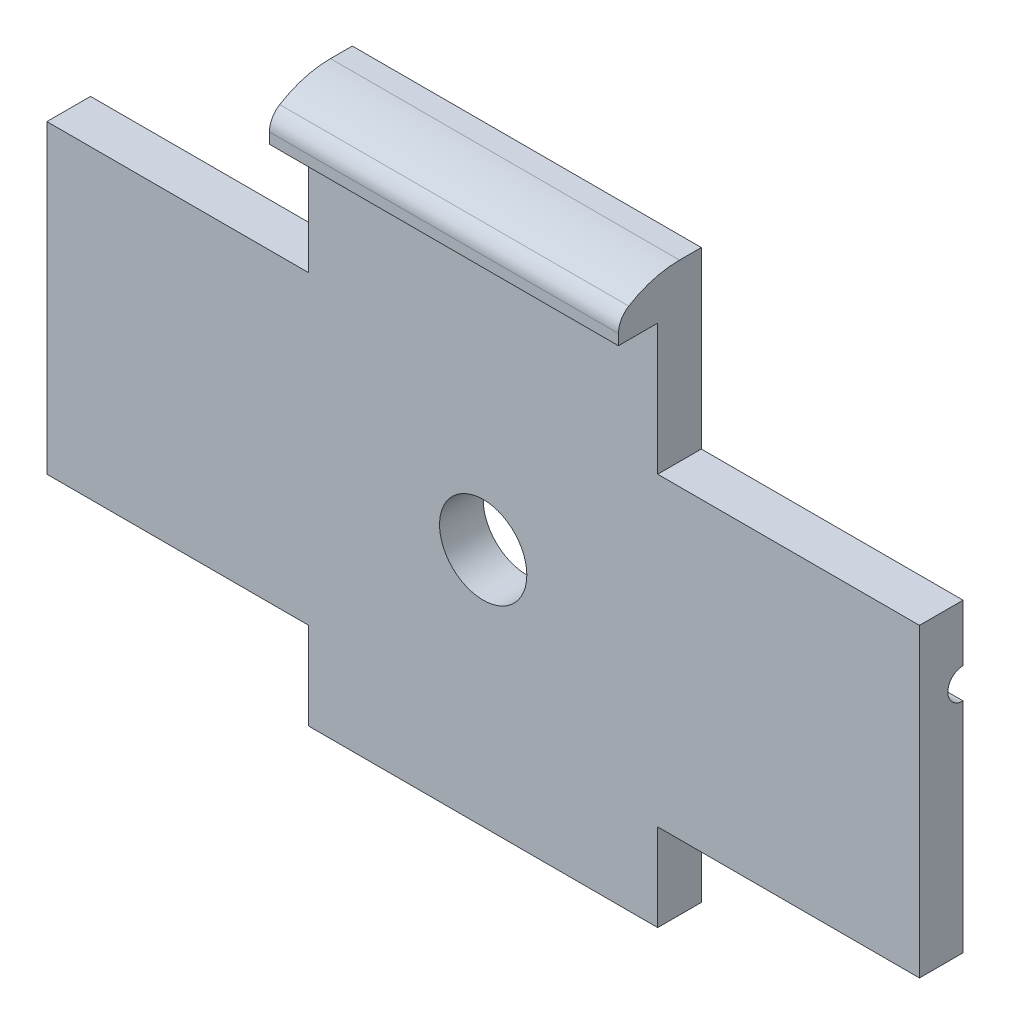
ISO-10303-21;
HEADER;
FILE_DESCRIPTION(('STEP AP214'),'2;1');
FILE_NAME('part.step','',(''),(''),'','','');
FILE_SCHEMA(('AUTOMOTIVE_DESIGN { 1 0 10303 214 1 1 1 1 }'));
ENDSEC;
DATA;
#1=APPLICATION_CONTEXT('core data for automotive mechanical design processes');
#2=APPLICATION_PROTOCOL_DEFINITION('international standard','automotive_design',2000,#1);
#3=PRODUCT_CONTEXT('',#1,'mechanical');
#4=PRODUCT('Part','Part','',(#3));
#5=PRODUCT_RELATED_PRODUCT_CATEGORY('part','',(#4));
#6=PRODUCT_DEFINITION_FORMATION('','',#4);
#7=PRODUCT_DEFINITION_CONTEXT('part definition',#1,'design');
#8=PRODUCT_DEFINITION('design','',#6,#7);
#9=PRODUCT_DEFINITION_SHAPE('','',#8);
#10=(LENGTH_UNIT() NAMED_UNIT(*) SI_UNIT(.MILLI.,.METRE.));
#11=(NAMED_UNIT(*) PLANE_ANGLE_UNIT() SI_UNIT($,.RADIAN.));
#12=(NAMED_UNIT(*) SI_UNIT($,.STERADIAN.) SOLID_ANGLE_UNIT());
#13=UNCERTAINTY_MEASURE_WITH_UNIT(LENGTH_MEASURE(1.E-05),#10,'distance_accuracy_value','');
#14=(GEOMETRIC_REPRESENTATION_CONTEXT(3) GLOBAL_UNCERTAINTY_ASSIGNED_CONTEXT((#13)) GLOBAL_UNIT_ASSIGNED_CONTEXT((#10,
#11,#12)) REPRESENTATION_CONTEXT('',''));
#15=CARTESIAN_POINT('',(0.,0.,0.));
#16=DIRECTION('',(0.,0.,1.));
#17=DIRECTION('',(1.,0.,0.));
#18=AXIS2_PLACEMENT_3D('',#15,#16,#17);
#19=CARTESIAN_POINT('',(-2.,1.75,0.5));
#20=DIRECTION('',(0.,-1.,0.));
#21=DIRECTION('',(1.,0.,0.));
#22=AXIS2_PLACEMENT_3D('',#19,#20,#21);
#23=PLANE('',#22);
#24=DIRECTION('',(-1.,0.,0.));
#25=VECTOR('',#24,1.);
#26=CARTESIAN_POINT('',(-2.,1.75,0.));
#27=LINE('',#26,#25);
#28=CARTESIAN_POINT('',(-2.,1.75,0.));
#29=VERTEX_POINT('',#28);
#30=CARTESIAN_POINT('',(-5.,1.75,0.));
#31=VERTEX_POINT('',#30);
#32=EDGE_CURVE('E224',#29,#31,#27,.T.);
#33=ORIENTED_EDGE('',*,*,#32,.T.);
#34=DIRECTION('',(0.,0.,-1.));
#35=VECTOR('',#34,1.);
#36=CARTESIAN_POINT('',(-5.,1.75,0.5));
#37=LINE('',#36,#35);
#38=CARTESIAN_POINT('',(-5.,1.75,0.5));
#39=VERTEX_POINT('',#38);
#40=EDGE_CURVE('E203',#39,#31,#37,.T.);
#41=ORIENTED_EDGE('',*,*,#40,.F.);
#42=DIRECTION('',(-1.,0.,0.));
#43=VECTOR('',#42,1.);
#44=CARTESIAN_POINT('',(-2.,1.75,0.5));
#45=LINE('',#44,#43);
#46=CARTESIAN_POINT('',(-2.,1.75,0.5));
#47=VERTEX_POINT('',#46);
#48=EDGE_CURVE('E251',#47,#39,#45,.T.);
#49=ORIENTED_EDGE('',*,*,#48,.F.);
#50=DIRECTION('',(0.,0.,-1.));
#51=VECTOR('',#50,1.);
#52=CARTESIAN_POINT('',(-2.,1.75,0.5));
#53=LINE('',#52,#51);
#54=EDGE_CURVE('E215',#47,#29,#53,.T.);
#55=ORIENTED_EDGE('',*,*,#54,.T.);
#56=EDGE_LOOP('',(#33,#41,#49,#55));
#57=FACE_BOUND('',#56,.T.);
#58=ADVANCED_FACE('F34',(#57),#23,.F.);
#59=CARTESIAN_POINT('',(-5.,1.75,0.5));
#60=DIRECTION('',(1.,0.,0.));
#61=DIRECTION('',(0.,0.,-1.));
#62=AXIS2_PLACEMENT_3D('',#59,#60,#61);
#63=PLANE('',#62);
#64=DIRECTION('',(0.,-1.,0.));
#65=VECTOR('',#64,1.);
#66=CARTESIAN_POINT('',(-5.,1.75,0.));
#67=LINE('',#66,#65);
#68=CARTESIAN_POINT('',(-5.,1.1,0.));
#69=VERTEX_POINT('',#68);
#70=EDGE_CURVE('E229',#31,#69,#67,.T.);
#71=ORIENTED_EDGE('',*,*,#70,.T.);
#72=CARTESIAN_POINT('',(-5.,0.925000000000001,0.));
#73=DIRECTION('',(-1.,0.,0.));
#74=DIRECTION('',(0.,0.,1.));
#75=AXIS2_PLACEMENT_3D('',#72,#73,#74);
#76=CIRCLE('',#75,0.175);
#77=CARTESIAN_POINT('',(-5.,0.750000000000001,0.));
#78=VERTEX_POINT('',#77);
#79=EDGE_CURVE('E186',#78,#69,#76,.T.);
#80=ORIENTED_EDGE('',*,*,#79,.F.);
#81=CARTESIAN_POINT('',(-5.,-1.75,0.));
#82=VERTEX_POINT('',#81);
#83=EDGE_CURVE('E227',#78,#82,#67,.T.);
#84=ORIENTED_EDGE('',*,*,#83,.T.);
#85=DIRECTION('',(0.,0.,-1.));
#86=VECTOR('',#85,1.);
#87=CARTESIAN_POINT('',(-5.,-1.75,0.5));
#88=LINE('',#87,#86);
#89=CARTESIAN_POINT('',(-5.,-1.75,0.5));
#90=VERTEX_POINT('',#89);
#91=EDGE_CURVE('E274',#90,#82,#88,.T.);
#92=ORIENTED_EDGE('',*,*,#91,.F.);
#93=DIRECTION('',(0.,-1.,0.));
#94=VECTOR('',#93,1.);
#95=CARTESIAN_POINT('',(-5.,1.75,0.5));
#96=LINE('',#95,#94);
#97=EDGE_CURVE('E285',#39,#90,#96,.T.);
#98=ORIENTED_EDGE('',*,*,#97,.F.);
#99=ORIENTED_EDGE('',*,*,#40,.T.);
#100=EDGE_LOOP('',(#71,#80,#84,#92,#98,#99));
#101=FACE_BOUND('',#100,.T.);
#102=ADVANCED_FACE('F283',(#101),#63,.F.);
#103=CARTESIAN_POINT('',(-5.,-1.75,0.5));
#104=DIRECTION('',(0.,1.,0.));
#105=DIRECTION('',(-1.,0.,0.));
#106=AXIS2_PLACEMENT_3D('',#103,#104,#105);
#107=PLANE('',#106);
#108=DIRECTION('',(1.,0.,0.));
#109=VECTOR('',#108,1.);
#110=CARTESIAN_POINT('',(-5.,-1.75,0.));
#111=LINE('',#110,#109);
#112=CARTESIAN_POINT('',(-2.,-1.75,0.));
#113=VERTEX_POINT('',#112);
#114=EDGE_CURVE('E232',#82,#113,#111,.T.);
#115=ORIENTED_EDGE('',*,*,#114,.T.);
#116=DIRECTION('',(0.,0.,-1.));
#117=VECTOR('',#116,1.);
#118=CARTESIAN_POINT('',(-2.,-1.75,0.5));
#119=LINE('',#118,#117);
#120=CARTESIAN_POINT('',(-2.,-1.75,0.5));
#121=VERTEX_POINT('',#120);
#122=EDGE_CURVE('E272',#121,#113,#119,.T.);
#123=ORIENTED_EDGE('',*,*,#122,.F.);
#124=DIRECTION('',(1.,0.,0.));
#125=VECTOR('',#124,1.);
#126=CARTESIAN_POINT('',(-5.,-1.75,0.5));
#127=LINE('',#126,#125);
#128=EDGE_CURVE('E328',#90,#121,#127,.T.);
#129=ORIENTED_EDGE('',*,*,#128,.F.);
#130=ORIENTED_EDGE('',*,*,#91,.T.);
#131=EDGE_LOOP('',(#115,#123,#129,#130));
#132=FACE_BOUND('',#131,.T.);
#133=ADVANCED_FACE('F404',(#132),#107,.F.);
#134=CARTESIAN_POINT('',(-2.,-1.75,0.5));
#135=DIRECTION('',(1.,0.,0.));
#136=DIRECTION('',(0.,0.,-1.));
#137=AXIS2_PLACEMENT_3D('',#134,#135,#136);
#138=PLANE('',#137);
#139=DIRECTION('',(0.,-1.,0.));
#140=VECTOR('',#139,1.);
#141=CARTESIAN_POINT('',(-2.,-1.75,0.));
#142=LINE('',#141,#140);
#143=CARTESIAN_POINT('',(-2.,-2.75,0.));
#144=VERTEX_POINT('',#143);
#145=EDGE_CURVE('E234',#113,#144,#142,.T.);
#146=ORIENTED_EDGE('',*,*,#145,.T.);
#147=DIRECTION('',(0.,0.,-1.));
#148=VECTOR('',#147,1.);
#149=CARTESIAN_POINT('',(-2.,-2.75,0.5));
#150=LINE('',#149,#148);
#151=CARTESIAN_POINT('',(-2.,-2.75,0.5));
#152=VERTEX_POINT('',#151);
#153=EDGE_CURVE('E269',#152,#144,#150,.T.);
#154=ORIENTED_EDGE('',*,*,#153,.F.);
#155=DIRECTION('',(0.,-1.,0.));
#156=VECTOR('',#155,1.);
#157=CARTESIAN_POINT('',(-2.,-1.75,0.5));
#158=LINE('',#157,#156);
#159=EDGE_CURVE('E330',#121,#152,#158,.T.);
#160=ORIENTED_EDGE('',*,*,#159,.F.);
#161=ORIENTED_EDGE('',*,*,#122,.T.);
#162=EDGE_LOOP('',(#146,#154,#160,#161));
#163=FACE_BOUND('',#162,.T.);
#164=ADVANCED_FACE('F408',(#163),#138,.F.);
#165=CARTESIAN_POINT('',(-2.,-2.75,0.5));
#166=DIRECTION('',(0.,1.,0.));
#167=DIRECTION('',(-1.,0.,0.));
#168=AXIS2_PLACEMENT_3D('',#165,#166,#167);
#169=PLANE('',#168);
#170=DIRECTION('',(1.,0.,0.));
#171=VECTOR('',#170,1.);
#172=CARTESIAN_POINT('',(-2.,-2.75,0.));
#173=LINE('',#172,#171);
#174=CARTESIAN_POINT('',(2.,-2.75,0.));
#175=VERTEX_POINT('',#174);
#176=EDGE_CURVE('E236',#144,#175,#173,.T.);
#177=ORIENTED_EDGE('',*,*,#176,.T.);
#178=DIRECTION('',(0.,0.,-1.));
#179=VECTOR('',#178,1.);
#180=CARTESIAN_POINT('',(2.,-2.75,0.5));
#181=LINE('',#180,#179);
#182=CARTESIAN_POINT('',(2.,-2.75,0.5));
#183=VERTEX_POINT('',#182);
#184=EDGE_CURVE('E266',#183,#175,#181,.T.);
#185=ORIENTED_EDGE('',*,*,#184,.F.);
#186=DIRECTION('',(1.,0.,0.));
#187=VECTOR('',#186,1.);
#188=CARTESIAN_POINT('',(-2.,-2.75,0.5));
#189=LINE('',#188,#187);
#190=EDGE_CURVE('E332',#152,#183,#189,.T.);
#191=ORIENTED_EDGE('',*,*,#190,.F.);
#192=ORIENTED_EDGE('',*,*,#153,.T.);
#193=EDGE_LOOP('',(#177,#185,#191,#192));
#194=FACE_BOUND('',#193,.T.);
#195=ADVANCED_FACE('F413',(#194),#169,.F.);
#196=CARTESIAN_POINT('',(2.,-2.75,0.5));
#197=DIRECTION('',(-1.,0.,0.));
#198=DIRECTION('',(0.,-1.,0.));
#199=AXIS2_PLACEMENT_3D('',#196,#197,#198);
#200=PLANE('',#199);
#201=DIRECTION('',(0.,1.,0.));
#202=VECTOR('',#201,1.);
#203=CARTESIAN_POINT('',(2.,-2.75,0.));
#204=LINE('',#203,#202);
#205=CARTESIAN_POINT('',(2.,-1.75,0.));
#206=VERTEX_POINT('',#205);
#207=EDGE_CURVE('E238',#175,#206,#204,.T.);
#208=ORIENTED_EDGE('',*,*,#207,.T.);
#209=DIRECTION('',(0.,0.,-1.));
#210=VECTOR('',#209,1.);
#211=CARTESIAN_POINT('',(2.,-1.75,0.5));
#212=LINE('',#211,#210);
#213=CARTESIAN_POINT('',(2.,-1.75,0.5));
#214=VERTEX_POINT('',#213);
#215=EDGE_CURVE('E263',#214,#206,#212,.T.);
#216=ORIENTED_EDGE('',*,*,#215,.F.);
#217=DIRECTION('',(0.,1.,0.));
#218=VECTOR('',#217,1.);
#219=CARTESIAN_POINT('',(2.,-2.75,0.5));
#220=LINE('',#219,#218);
#221=EDGE_CURVE('E334',#183,#214,#220,.T.);
#222=ORIENTED_EDGE('',*,*,#221,.F.);
#223=ORIENTED_EDGE('',*,*,#184,.T.);
#224=EDGE_LOOP('',(#208,#216,#222,#223));
#225=FACE_BOUND('',#224,.T.);
#226=ADVANCED_FACE('F417',(#225),#200,.F.);
#227=CARTESIAN_POINT('',(2.,-1.75,0.5));
#228=DIRECTION('',(0.,1.,0.));
#229=DIRECTION('',(-1.,0.,0.));
#230=AXIS2_PLACEMENT_3D('',#227,#228,#229);
#231=PLANE('',#230);
#232=DIRECTION('',(1.,0.,0.));
#233=VECTOR('',#232,1.);
#234=CARTESIAN_POINT('',(2.,-1.75,0.));
#235=LINE('',#234,#233);
#236=CARTESIAN_POINT('',(5.,-1.75,0.));
#237=VERTEX_POINT('',#236);
#238=EDGE_CURVE('E240',#206,#237,#235,.T.);
#239=ORIENTED_EDGE('',*,*,#238,.T.);
#240=DIRECTION('',(0.,0.,-1.));
#241=VECTOR('',#240,1.);
#242=CARTESIAN_POINT('',(5.,-1.75,0.5));
#243=LINE('',#242,#241);
#244=CARTESIAN_POINT('',(5.,-1.75,0.5));
#245=VERTEX_POINT('',#244);
#246=EDGE_CURVE('E260',#245,#237,#243,.T.);
#247=ORIENTED_EDGE('',*,*,#246,.F.);
#248=DIRECTION('',(1.,0.,0.));
#249=VECTOR('',#248,1.);
#250=CARTESIAN_POINT('',(2.,-1.75,0.5));
#251=LINE('',#250,#249);
#252=EDGE_CURVE('E336',#214,#245,#251,.T.);
#253=ORIENTED_EDGE('',*,*,#252,.F.);
#254=ORIENTED_EDGE('',*,*,#215,.T.);
#255=EDGE_LOOP('',(#239,#247,#253,#254));
#256=FACE_BOUND('',#255,.T.);
#257=ADVANCED_FACE('F421',(#256),#231,.F.);
#258=CARTESIAN_POINT('',(5.,-1.75,0.5));
#259=DIRECTION('',(-1.,0.,0.));
#260=DIRECTION('',(0.,0.,1.));
#261=AXIS2_PLACEMENT_3D('',#258,#259,#260);
#262=PLANE('',#261);
#263=DIRECTION('',(0.,1.,0.));
#264=VECTOR('',#263,1.);
#265=CARTESIAN_POINT('',(5.,-1.75,0.));
#266=LINE('',#265,#264);
#267=CARTESIAN_POINT('',(5.,0.75,0.));
#268=VERTEX_POINT('',#267);
#269=EDGE_CURVE('E242',#237,#268,#266,.T.);
#270=ORIENTED_EDGE('',*,*,#269,.T.);
#271=CARTESIAN_POINT('',(5.,0.925,0.));
#272=DIRECTION('',(1.,0.,0.));
#273=DIRECTION('',(0.,0.,-1.));
#274=AXIS2_PLACEMENT_3D('',#271,#272,#273);
#275=CIRCLE('',#274,0.175);
#276=CARTESIAN_POINT('',(5.,1.1,0.));
#277=VERTEX_POINT('',#276);
#278=EDGE_CURVE('E187',#277,#268,#275,.T.);
#279=ORIENTED_EDGE('',*,*,#278,.F.);
#280=CARTESIAN_POINT('',(5.,1.75,0.));
#281=VERTEX_POINT('',#280);
#282=EDGE_CURVE('E192',#277,#281,#266,.T.);
#283=ORIENTED_EDGE('',*,*,#282,.T.);
#284=DIRECTION('',(0.,0.,-1.));
#285=VECTOR('',#284,1.);
#286=CARTESIAN_POINT('',(5.,1.75,0.5));
#287=LINE('',#286,#285);
#288=CARTESIAN_POINT('',(5.,1.75,0.5));
#289=VERTEX_POINT('',#288);
#290=EDGE_CURVE('E257',#289,#281,#287,.T.);
#291=ORIENTED_EDGE('',*,*,#290,.F.);
#292=DIRECTION('',(0.,1.,0.));
#293=VECTOR('',#292,1.);
#294=CARTESIAN_POINT('',(5.,-1.75,0.5));
#295=LINE('',#294,#293);
#296=EDGE_CURVE('E337',#245,#289,#295,.T.);
#297=ORIENTED_EDGE('',*,*,#296,.F.);
#298=ORIENTED_EDGE('',*,*,#246,.T.);
#299=EDGE_LOOP('',(#270,#279,#283,#291,#297,#298));
#300=FACE_BOUND('',#299,.T.);
#301=ADVANCED_FACE('F425',(#300),#262,.F.);
#302=CARTESIAN_POINT('',(5.,1.75,0.5));
#303=DIRECTION('',(0.,-1.,0.));
#304=DIRECTION('',(0.,0.,-1.));
#305=AXIS2_PLACEMENT_3D('',#302,#303,#304);
#306=PLANE('',#305);
#307=DIRECTION('',(-1.,0.,0.));
#308=VECTOR('',#307,1.);
#309=CARTESIAN_POINT('',(5.,1.75,0.));
#310=LINE('',#309,#308);
#311=CARTESIAN_POINT('',(2.,1.75,0.));
#312=VERTEX_POINT('',#311);
#313=EDGE_CURVE('E245',#281,#312,#310,.T.);
#314=ORIENTED_EDGE('',*,*,#313,.T.);
#315=DIRECTION('',(0.,0.,-1.));
#316=VECTOR('',#315,1.);
#317=CARTESIAN_POINT('',(2.,1.75,0.5));
#318=LINE('',#317,#316);
#319=CARTESIAN_POINT('',(2.,1.75,0.5));
#320=VERTEX_POINT('',#319);
#321=EDGE_CURVE('E254',#320,#312,#318,.T.);
#322=ORIENTED_EDGE('',*,*,#321,.F.);
#323=DIRECTION('',(-1.,0.,0.));
#324=VECTOR('',#323,1.);
#325=CARTESIAN_POINT('',(5.,1.75,0.5));
#326=LINE('',#325,#324);
#327=EDGE_CURVE('E210',#289,#320,#326,.T.);
#328=ORIENTED_EDGE('',*,*,#327,.F.);
#329=ORIENTED_EDGE('',*,*,#290,.T.);
#330=EDGE_LOOP('',(#314,#322,#328,#329));
#331=FACE_BOUND('',#330,.T.);
#332=ADVANCED_FACE('F346',(#331),#306,.F.);
#333=CARTESIAN_POINT('',(2.,1.75,0.5));
#334=DIRECTION('',(-1.,0.,0.));
#335=DIRECTION('',(0.,-1.,0.));
#336=AXIS2_PLACEMENT_3D('',#333,#334,#335);
#337=PLANE('',#336);
#338=DIRECTION('',(0.,1.,0.));
#339=VECTOR('',#338,1.);
#340=CARTESIAN_POINT('',(2.,1.75,0.));
#341=LINE('',#340,#339);
#342=CARTESIAN_POINT('',(2.,3.75,0.));
#343=VERTEX_POINT('',#342);
#344=EDGE_CURVE('E247',#312,#343,#341,.T.);
#345=ORIENTED_EDGE('',*,*,#344,.T.);
#346=DIRECTION('',(0.,0.,-1.));
#347=VECTOR('',#346,1.);
#348=CARTESIAN_POINT('',(2.,3.75,0.));
#349=LINE('',#348,#347);
#350=CARTESIAN_POINT('',(2.,3.75,0.25));
#351=VERTEX_POINT('',#350);
#352=EDGE_CURVE('E323',#351,#343,#349,.T.);
#353=ORIENTED_EDGE('',*,*,#352,.F.);
#354=CARTESIAN_POINT('',(2.,2.645,0.25));
#355=DIRECTION('',(-1.,0.,0.));
#356=DIRECTION('',(0.,-1.,0.));
#357=AXIS2_PLACEMENT_3D('',#354,#355,#356);
#358=CIRCLE('',#357,1.105);
#359=CARTESIAN_POINT('',(2.,3.58456954398163,0.831578947368421));
#360=VERTEX_POINT('',#359);
#361=EDGE_CURVE('E375',#360,#351,#358,.T.);
#362=ORIENTED_EDGE('',*,*,#361,.F.);
#363=CARTESIAN_POINT('',(2.,3.37199724896316,0.7));
#364=DIRECTION('',(-1.,0.,0.));
#365=DIRECTION('',(0.,-1.,0.));
#366=AXIS2_PLACEMENT_3D('',#363,#364,#365);
#367=CIRCLE('',#366,0.25);
#368=CARTESIAN_POINT('',(2.,3.37199724896316,0.95));
#369=VERTEX_POINT('',#368);
#370=EDGE_CURVE('E358',#369,#360,#367,.T.);
#371=ORIENTED_EDGE('',*,*,#370,.F.);
#372=DIRECTION('',(0.,1.,0.));
#373=VECTOR('',#372,1.);
#374=CARTESIAN_POINT('',(2.,3.25,0.95));
#375=LINE('',#374,#373);
#376=CARTESIAN_POINT('',(2.,3.25,0.95));
#377=VERTEX_POINT('',#376);
#378=EDGE_CURVE('E353',#377,#369,#375,.T.);
#379=ORIENTED_EDGE('',*,*,#378,.F.);
#380=DIRECTION('',(0.,0.,1.));
#381=VECTOR('',#380,1.);
#382=CARTESIAN_POINT('',(2.,3.25,0.));
#383=LINE('',#382,#381);
#384=CARTESIAN_POINT('',(2.,3.25,0.5));
#385=VERTEX_POINT('',#384);
#386=EDGE_CURVE('E318',#385,#377,#383,.T.);
#387=ORIENTED_EDGE('',*,*,#386,.F.);
#388=DIRECTION('',(0.,1.,0.));
#389=VECTOR('',#388,1.);
#390=CARTESIAN_POINT('',(2.,1.75,0.5));
#391=LINE('',#390,#389);
#392=EDGE_CURVE('E206',#320,#385,#391,.T.);
#393=ORIENTED_EDGE('',*,*,#392,.F.);
#394=ORIENTED_EDGE('',*,*,#321,.T.);
#395=EDGE_LOOP('',(#345,#353,#362,#371,#379,#387,#393,#394));
#396=FACE_BOUND('',#395,.T.);
#397=ADVANCED_FACE('F350',(#396),#337,.F.);
#398=CARTESIAN_POINT('',(-2.,3.25,0.5));
#399=DIRECTION('',(1.,0.,0.));
#400=DIRECTION('',(0.,1.,0.));
#401=AXIS2_PLACEMENT_3D('',#398,#399,#400);
#402=PLANE('',#401);
#403=DIRECTION('',(0.,-1.,0.));
#404=VECTOR('',#403,1.);
#405=CARTESIAN_POINT('',(-2.,3.25,0.));
#406=LINE('',#405,#404);
#407=CARTESIAN_POINT('',(-2.,3.75,0.));
#408=VERTEX_POINT('',#407);
#409=EDGE_CURVE('E249',#408,#29,#406,.T.);
#410=ORIENTED_EDGE('',*,*,#409,.T.);
#411=ORIENTED_EDGE('',*,*,#54,.F.);
#412=DIRECTION('',(0.,-1.,0.));
#413=VECTOR('',#412,1.);
#414=CARTESIAN_POINT('',(-2.,3.25,0.5));
#415=LINE('',#414,#413);
#416=CARTESIAN_POINT('',(-2.,3.25,0.5));
#417=VERTEX_POINT('',#416);
#418=EDGE_CURVE('E213',#417,#47,#415,.T.);
#419=ORIENTED_EDGE('',*,*,#418,.F.);
#420=DIRECTION('',(0.,0.,1.));
#421=VECTOR('',#420,1.);
#422=CARTESIAN_POINT('',(-2.,3.25,0.));
#423=LINE('',#422,#421);
#424=CARTESIAN_POINT('',(-2.,3.25,0.95));
#425=VERTEX_POINT('',#424);
#426=EDGE_CURVE('E310',#417,#425,#423,.T.);
#427=ORIENTED_EDGE('',*,*,#426,.T.);
#428=DIRECTION('',(0.,1.,0.));
#429=VECTOR('',#428,1.);
#430=CARTESIAN_POINT('',(-2.,3.25,0.95));
#431=LINE('',#430,#429);
#432=CARTESIAN_POINT('',(-2.,3.37199724896316,0.95));
#433=VERTEX_POINT('',#432);
#434=EDGE_CURVE('E307',#425,#433,#431,.T.);
#435=ORIENTED_EDGE('',*,*,#434,.T.);
#436=CARTESIAN_POINT('',(-2.,3.37199724896316,0.7));
#437=DIRECTION('',(1.,0.,0.));
#438=DIRECTION('',(0.,1.,0.));
#439=AXIS2_PLACEMENT_3D('',#436,#437,#438);
#440=CIRCLE('',#439,0.25);
#441=CARTESIAN_POINT('',(-2.,3.58456954398163,0.831578947368421));
#442=VERTEX_POINT('',#441);
#443=EDGE_CURVE('E301',#433,#442,#440,.F.);
#444=ORIENTED_EDGE('',*,*,#443,.T.);
#445=CARTESIAN_POINT('',(-2.,2.645,0.25));
#446=DIRECTION('',(1.,0.,0.));
#447=DIRECTION('',(0.,1.,0.));
#448=AXIS2_PLACEMENT_3D('',#445,#446,#447);
#449=CIRCLE('',#448,1.105);
#450=CARTESIAN_POINT('',(-2.,3.75,0.25));
#451=VERTEX_POINT('',#450);
#452=EDGE_CURVE('E298',#442,#451,#449,.F.);
#453=ORIENTED_EDGE('',*,*,#452,.T.);
#454=DIRECTION('',(0.,0.,-1.));
#455=VECTOR('',#454,1.);
#456=CARTESIAN_POINT('',(-2.,3.75,0.));
#457=LINE('',#456,#455);
#458=EDGE_CURVE('E313',#451,#408,#457,.T.);
#459=ORIENTED_EDGE('',*,*,#458,.T.);
#460=EDGE_LOOP('',(#410,#411,#419,#427,#435,#444,#453,#459));
#461=FACE_BOUND('',#460,.T.);
#462=ADVANCED_FACE('F389',(#461),#402,.F.);
#463=CARTESIAN_POINT('',(-5.,1.75,0.5));
#464=DIRECTION('',(0.,0.,1.));
#465=DIRECTION('',(1.,0.,0.));
#466=AXIS2_PLACEMENT_3D('',#463,#464,#465);
#467=PLANE('',#466);
#468=CARTESIAN_POINT('',(0.,0.,0.5));
#469=DIRECTION('',(0.,0.,1.));
#470=DIRECTION('',(1.,0.,0.));
#471=AXIS2_PLACEMENT_3D('',#468,#469,#470);
#472=CIRCLE('',#471,0.5);
#473=CARTESIAN_POINT('',(0.5,0.,0.5));
#474=VERTEX_POINT('',#473);
#475=EDGE_CURVE('E320',#474,#474,#472,.T.);
#476=ORIENTED_EDGE('',*,*,#475,.F.);
#477=EDGE_LOOP('',(#476));
#478=FACE_BOUND('',#477,.T.);
#479=ORIENTED_EDGE('',*,*,#48,.T.);
#480=ORIENTED_EDGE('',*,*,#97,.T.);
#481=ORIENTED_EDGE('',*,*,#128,.T.);
#482=ORIENTED_EDGE('',*,*,#159,.T.);
#483=ORIENTED_EDGE('',*,*,#190,.T.);
#484=ORIENTED_EDGE('',*,*,#221,.T.);
#485=ORIENTED_EDGE('',*,*,#252,.T.);
#486=ORIENTED_EDGE('',*,*,#296,.T.);
#487=ORIENTED_EDGE('',*,*,#327,.T.);
#488=ORIENTED_EDGE('',*,*,#392,.T.);
#489=DIRECTION('',(-1.,0.,0.));
#490=VECTOR('',#489,1.);
#491=CARTESIAN_POINT('',(2.,3.25,0.5));
#492=LINE('',#491,#490);
#493=EDGE_CURVE('E209',#385,#417,#492,.T.);
#494=ORIENTED_EDGE('',*,*,#493,.T.);
#495=ORIENTED_EDGE('',*,*,#418,.T.);
#496=EDGE_LOOP('',(#479,#480,#481,#482,#483,#484,#485,#486,#487,#488,#494,#495));
#497=FACE_BOUND('',#496,.T.);
#498=ADVANCED_FACE('F343',(#478,#497),#467,.T.);
#499=CARTESIAN_POINT('',(-5.,1.75,0.));
#500=DIRECTION('',(0.,0.,1.));
#501=DIRECTION('',(1.,0.,0.));
#502=AXIS2_PLACEMENT_3D('',#499,#500,#501);
#503=PLANE('',#502);
#504=CARTESIAN_POINT('',(0.,0.,0.));
#505=DIRECTION('',(0.,0.,1.));
#506=DIRECTION('',(1.,0.,0.));
#507=AXIS2_PLACEMENT_3D('',#504,#505,#506);
#508=CIRCLE('',#507,0.5);
#509=CARTESIAN_POINT('',(0.5,0.,0.));
#510=VERTEX_POINT('',#509);
#511=EDGE_CURVE('E228',#510,#510,#508,.F.);
#512=ORIENTED_EDGE('',*,*,#511,.F.);
#513=EDGE_LOOP('',(#512));
#514=FACE_BOUND('',#513,.T.);
#515=DIRECTION('',(0.515038074910058,-0.85716730070211,0.));
#516=VECTOR('',#515,1.);
#517=CARTESIAN_POINT('',(1.89484939167018,0.925,0.));
#518=LINE('',#517,#516);
#519=CARTESIAN_POINT('',(1.89484939167018,0.925,0.));
#520=VERTEX_POINT('',#519);
#521=CARTESIAN_POINT('',(2.,0.750000000000001,0.));
#522=VERTEX_POINT('',#521);
#523=EDGE_CURVE('E48',#520,#522,#518,.T.);
#524=ORIENTED_EDGE('',*,*,#523,.T.);
#525=DIRECTION('',(1.,0.,0.));
#526=VECTOR('',#525,1.);
#527=CARTESIAN_POINT('',(5.,0.750000000000001,0.));
#528=LINE('',#527,#526);
#529=EDGE_CURVE('E11',#522,#268,#528,.T.);
#530=ORIENTED_EDGE('',*,*,#529,.T.);
#531=ORIENTED_EDGE('',*,*,#269,.F.);
#532=ORIENTED_EDGE('',*,*,#238,.F.);
#533=ORIENTED_EDGE('',*,*,#207,.F.);
#534=ORIENTED_EDGE('',*,*,#176,.F.);
#535=ORIENTED_EDGE('',*,*,#145,.F.);
#536=ORIENTED_EDGE('',*,*,#114,.F.);
#537=ORIENTED_EDGE('',*,*,#83,.F.);
#538=DIRECTION('',(-1.,0.,0.));
#539=VECTOR('',#538,1.);
#540=CARTESIAN_POINT('',(-5.,0.750000000000002,0.));
#541=LINE('',#540,#539);
#542=CARTESIAN_POINT('',(-2.,0.750000000000002,0.));
#543=VERTEX_POINT('',#542);
#544=EDGE_CURVE('E198',#78,#543,#541,.F.);
#545=ORIENTED_EDGE('',*,*,#544,.T.);
#546=DIRECTION('',(0.515038074910058,0.85716730070211,0.));
#547=VECTOR('',#546,1.);
#548=CARTESIAN_POINT('',(-1.89484939167018,0.925000000000001,0.));
#549=LINE('',#548,#547);
#550=CARTESIAN_POINT('',(-1.89484939167018,0.925000000000001,0.));
#551=VERTEX_POINT('',#550);
#552=EDGE_CURVE('E201',#543,#551,#549,.T.);
#553=ORIENTED_EDGE('',*,*,#552,.T.);
#554=DIRECTION('',(-0.515038074910058,0.85716730070211,0.));
#555=VECTOR('',#554,1.);
#556=CARTESIAN_POINT('',(-1.89484939167018,0.925000000000001,0.));
#557=LINE('',#556,#555);
#558=CARTESIAN_POINT('',(-2.,1.1,0.));
#559=VERTEX_POINT('',#558);
#560=EDGE_CURVE('E56',#551,#559,#557,.T.);
#561=ORIENTED_EDGE('',*,*,#560,.T.);
#562=DIRECTION('',(-1.,0.,0.));
#563=VECTOR('',#562,1.);
#564=CARTESIAN_POINT('',(-5.,1.1,0.));
#565=LINE('',#564,#563);
#566=EDGE_CURVE('E181',#559,#69,#565,.T.);
#567=ORIENTED_EDGE('',*,*,#566,.T.);
#568=ORIENTED_EDGE('',*,*,#70,.F.);
#569=ORIENTED_EDGE('',*,*,#32,.F.);
#570=ORIENTED_EDGE('',*,*,#409,.F.);
#571=DIRECTION('',(-1.,0.,0.));
#572=VECTOR('',#571,1.);
#573=CARTESIAN_POINT('',(3.07354552767919,3.75,0.));
#574=LINE('',#573,#572);
#575=EDGE_CURVE('E357',#343,#408,#574,.T.);
#576=ORIENTED_EDGE('',*,*,#575,.F.);
#577=ORIENTED_EDGE('',*,*,#344,.F.);
#578=ORIENTED_EDGE('',*,*,#313,.F.);
#579=ORIENTED_EDGE('',*,*,#282,.F.);
#580=DIRECTION('',(1.,0.,0.));
#581=VECTOR('',#580,1.);
#582=CARTESIAN_POINT('',(5.,1.1,0.));
#583=LINE('',#582,#581);
#584=CARTESIAN_POINT('',(2.,1.1,0.));
#585=VERTEX_POINT('',#584);
#586=EDGE_CURVE('E41',#277,#585,#583,.F.);
#587=ORIENTED_EDGE('',*,*,#586,.T.);
#588=DIRECTION('',(-0.515038074910058,-0.85716730070211,0.));
#589=VECTOR('',#588,1.);
#590=CARTESIAN_POINT('',(1.89484939167018,0.925,0.));
#591=LINE('',#590,#589);
#592=EDGE_CURVE('E175',#585,#520,#591,.T.);
#593=ORIENTED_EDGE('',*,*,#592,.T.);
#594=EDGE_LOOP('',(#524,#530,#531,#532,#533,#534,#535,#536,#537,#545,#553,#561,#567,#568,#569,
#570,#576,#577,#578,#579,#587,#593));
#595=FACE_BOUND('',#594,.T.);
#596=ADVANCED_FACE('F190',(#514,#595),#503,.F.);
#597=CARTESIAN_POINT('',(0.,0.,-1.4142135623731));
#598=DIRECTION('',(0.,0.,1.));
#599=DIRECTION('',(1.,0.,0.));
#600=AXIS2_PLACEMENT_3D('',#597,#598,#599);
#601=CYLINDRICAL_SURFACE('',#600,0.5);
#602=ORIENTED_EDGE('',*,*,#511,.T.);
#603=EDGE_LOOP('',(#602));
#604=FACE_BOUND('',#603,.T.);
#605=ORIENTED_EDGE('',*,*,#475,.T.);
#606=EDGE_LOOP('',(#605));
#607=FACE_BOUND('',#606,.T.);
#608=ADVANCED_FACE('F438',(#604,#607),#601,.F.);
#609=CARTESIAN_POINT('',(3.07354552767919,3.25,0.));
#610=DIRECTION('',(0.,1.,0.));
#611=DIRECTION('',(0.,0.,1.));
#612=AXIS2_PLACEMENT_3D('',#609,#610,#611);
#613=PLANE('',#612);
#614=ORIENTED_EDGE('',*,*,#493,.F.);
#615=ORIENTED_EDGE('',*,*,#386,.T.);
#616=DIRECTION('',(-1.,0.,0.));
#617=VECTOR('',#616,1.);
#618=CARTESIAN_POINT('',(3.07354552767919,3.25,0.95));
#619=LINE('',#618,#617);
#620=EDGE_CURVE('E372',#377,#425,#619,.T.);
#621=ORIENTED_EDGE('',*,*,#620,.T.);
#622=ORIENTED_EDGE('',*,*,#426,.F.);
#623=EDGE_LOOP('',(#614,#615,#621,#622));
#624=FACE_BOUND('',#623,.T.);
#625=ADVANCED_FACE('F443',(#624),#613,.F.);
#626=CARTESIAN_POINT('',(3.07354552767919,3.25,0.95));
#627=DIRECTION('',(0.,0.,-1.));
#628=DIRECTION('',(-1.,0.,0.));
#629=AXIS2_PLACEMENT_3D('',#626,#627,#628);
#630=PLANE('',#629);
#631=ORIENTED_EDGE('',*,*,#620,.F.);
#632=ORIENTED_EDGE('',*,*,#378,.T.);
#633=DIRECTION('',(-1.,0.,0.));
#634=VECTOR('',#633,1.);
#635=CARTESIAN_POINT('',(3.07354552767919,3.37199724896316,0.95));
#636=LINE('',#635,#634);
#637=EDGE_CURVE('E370',#369,#433,#636,.T.);
#638=ORIENTED_EDGE('',*,*,#637,.T.);
#639=ORIENTED_EDGE('',*,*,#434,.F.);
#640=EDGE_LOOP('',(#631,#632,#638,#639));
#641=FACE_BOUND('',#640,.T.);
#642=ADVANCED_FACE('F448',(#641),#630,.F.);
#643=CARTESIAN_POINT('',(3.07354552767919,3.37199724896316,0.7));
#644=DIRECTION('',(-1.,0.,0.));
#645=DIRECTION('',(0.,0.,1.));
#646=AXIS2_PLACEMENT_3D('',#643,#644,#645);
#647=CYLINDRICAL_SURFACE('',#646,0.25);
#648=ORIENTED_EDGE('',*,*,#637,.F.);
#649=ORIENTED_EDGE('',*,*,#370,.T.);
#650=DIRECTION('',(-1.,0.,0.));
#651=VECTOR('',#650,1.);
#652=CARTESIAN_POINT('',(3.07354552767919,3.58456954398163,0.831578947368421));
#653=LINE('',#652,#651);
#654=EDGE_CURVE('E365',#360,#442,#653,.T.);
#655=ORIENTED_EDGE('',*,*,#654,.T.);
#656=ORIENTED_EDGE('',*,*,#443,.F.);
#657=EDGE_LOOP('',(#648,#649,#655,#656));
#658=FACE_BOUND('',#657,.T.);
#659=ADVANCED_FACE('F381',(#658),#647,.T.);
#660=CARTESIAN_POINT('',(3.07354552767919,2.645,0.25));
#661=DIRECTION('',(-1.,0.,0.));
#662=DIRECTION('',(0.,0.,1.));
#663=AXIS2_PLACEMENT_3D('',#660,#661,#662);
#664=CYLINDRICAL_SURFACE('',#663,1.105);
#665=ORIENTED_EDGE('',*,*,#654,.F.);
#666=ORIENTED_EDGE('',*,*,#361,.T.);
#667=DIRECTION('',(-1.,0.,0.));
#668=VECTOR('',#667,1.);
#669=CARTESIAN_POINT('',(3.07354552767919,3.75,0.25));
#670=LINE('',#669,#668);
#671=EDGE_CURVE('E359',#351,#451,#670,.T.);
#672=ORIENTED_EDGE('',*,*,#671,.T.);
#673=ORIENTED_EDGE('',*,*,#452,.F.);
#674=EDGE_LOOP('',(#665,#666,#672,#673));
#675=FACE_BOUND('',#674,.T.);
#676=ADVANCED_FACE('F387',(#675),#664,.T.);
#677=CARTESIAN_POINT('',(3.07354552767919,3.75,0.));
#678=DIRECTION('',(0.,-1.,0.));
#679=DIRECTION('',(0.,0.,-1.));
#680=AXIS2_PLACEMENT_3D('',#677,#678,#679);
#681=PLANE('',#680);
#682=ORIENTED_EDGE('',*,*,#671,.F.);
#683=ORIENTED_EDGE('',*,*,#352,.T.);
#684=ORIENTED_EDGE('',*,*,#575,.T.);
#685=ORIENTED_EDGE('',*,*,#458,.F.);
#686=EDGE_LOOP('',(#682,#683,#684,#685));
#687=FACE_BOUND('',#686,.T.);
#688=ADVANCED_FACE('F390',(#687),#681,.F.);
#689=CARTESIAN_POINT('',(-5.,0.925000000000001,0.));
#690=DIRECTION('',(-1.,0.,0.));
#691=DIRECTION('',(0.,0.,1.));
#692=AXIS2_PLACEMENT_3D('',#689,#690,#691);
#693=CYLINDRICAL_SURFACE('',#692,0.174999999999999);
#694=CARTESIAN_POINT('',(-2.,0.925000000000001,0.));
#695=DIRECTION('',(-1.,0.,0.));
#696=DIRECTION('',(0.,0.,1.));
#697=AXIS2_PLACEMENT_3D('',#694,#695,#696);
#698=CIRCLE('',#697,0.174999999999999);
#699=EDGE_CURVE('E296',#543,#559,#698,.T.);
#700=ORIENTED_EDGE('',*,*,#699,.F.);
#701=ORIENTED_EDGE('',*,*,#544,.F.);
#702=ORIENTED_EDGE('',*,*,#79,.T.);
#703=ORIENTED_EDGE('',*,*,#566,.F.);
#704=EDGE_LOOP('',(#700,#701,#702,#703));
#705=FACE_BOUND('',#704,.T.);
#706=ADVANCED_FACE('F295',(#705),#693,.F.);
#707=CARTESIAN_POINT('',(-2.,0.925000000000001,0.));
#708=DIRECTION('',(-1.,0.,0.));
#709=DIRECTION('',(0.,0.,1.));
#710=AXIS2_PLACEMENT_3D('',#707,#708,#709);
#711=CONICAL_SURFACE('',#710,0.174999999999999,1.02974425867665);
#712=ORIENTED_EDGE('',*,*,#552,.F.);
#713=ORIENTED_EDGE('',*,*,#699,.T.);
#714=ORIENTED_EDGE('',*,*,#560,.F.);
#715=EDGE_LOOP('',(#712,#713,#714));
#716=FACE_BOUND('',#715,.T.);
#717=ADVANCED_FACE('F297',(#716),#711,.F.);
#718=CARTESIAN_POINT('',(5.,0.925,0.));
#719=DIRECTION('',(1.,0.,0.));
#720=DIRECTION('',(0.,0.,-1.));
#721=AXIS2_PLACEMENT_3D('',#718,#719,#720);
#722=CYLINDRICAL_SURFACE('',#721,0.174999999999999);
#723=CARTESIAN_POINT('',(2.,0.925,0.));
#724=DIRECTION('',(1.,0.,0.));
#725=DIRECTION('',(0.,0.,-1.));
#726=AXIS2_PLACEMENT_3D('',#723,#724,#725);
#727=CIRCLE('',#726,0.174999999999999);
#728=EDGE_CURVE('E178',#585,#522,#727,.T.);
#729=ORIENTED_EDGE('',*,*,#728,.F.);
#730=ORIENTED_EDGE('',*,*,#586,.F.);
#731=ORIENTED_EDGE('',*,*,#278,.T.);
#732=ORIENTED_EDGE('',*,*,#529,.F.);
#733=EDGE_LOOP('',(#729,#730,#731,#732));
#734=FACE_BOUND('',#733,.T.);
#735=ADVANCED_FACE('F184',(#734),#722,.F.);
#736=CARTESIAN_POINT('',(2.,0.925,0.));
#737=DIRECTION('',(1.,0.,0.));
#738=DIRECTION('',(0.,0.,-1.));
#739=AXIS2_PLACEMENT_3D('',#736,#737,#738);
#740=CONICAL_SURFACE('',#739,0.174999999999999,1.02974425867665);
#741=ORIENTED_EDGE('',*,*,#592,.F.);
#742=ORIENTED_EDGE('',*,*,#728,.T.);
#743=ORIENTED_EDGE('',*,*,#523,.F.);
#744=EDGE_LOOP('',(#741,#742,#743));
#745=FACE_BOUND('',#744,.T.);
#746=ADVANCED_FACE('F177',(#745),#740,.F.);
#747=CLOSED_SHELL('',(#58,#102,#133,#164,#195,#226,#257,#301,#332,#397,#462,#498,#596,#608,#625,
#642,#659,#676,#688,#706,#717,#735,#746));
#748=MANIFOLD_SOLID_BREP('B2',#747);
#749=ADVANCED_BREP_SHAPE_REPRESENTATION('',(#18,#748),#14);
#750=SHAPE_DEFINITION_REPRESENTATION(#9,#749);
ENDSEC;
END-ISO-10303-21;
